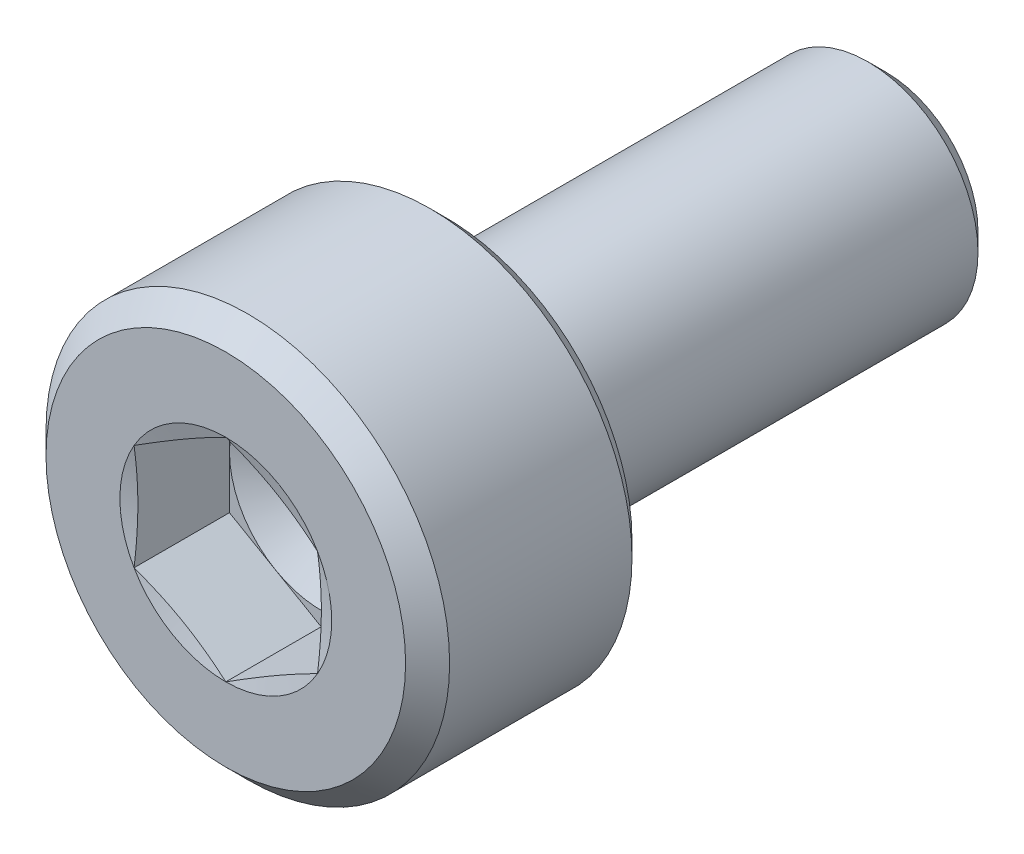
ISO-10303-21;
HEADER;
FILE_DESCRIPTION(('STEP AP214'),'2;1');
FILE_NAME('part.step','',(''),(''),'','','');
FILE_SCHEMA(('AUTOMOTIVE_DESIGN { 1 0 10303 214 1 1 1 1 }'));
ENDSEC;
DATA;
#1=APPLICATION_CONTEXT('core data for automotive mechanical design processes');
#2=APPLICATION_PROTOCOL_DEFINITION('international standard','automotive_design',2000,#1);
#3=PRODUCT_CONTEXT('',#1,'mechanical');
#4=PRODUCT('Part','Part','',(#3));
#5=PRODUCT_RELATED_PRODUCT_CATEGORY('part','',(#4));
#6=PRODUCT_DEFINITION_FORMATION('','',#4);
#7=PRODUCT_DEFINITION_CONTEXT('part definition',#1,'design');
#8=PRODUCT_DEFINITION('design','',#6,#7);
#9=PRODUCT_DEFINITION_SHAPE('','',#8);
#10=(LENGTH_UNIT() NAMED_UNIT(*) SI_UNIT(.MILLI.,.METRE.));
#11=(NAMED_UNIT(*) PLANE_ANGLE_UNIT() SI_UNIT($,.RADIAN.));
#12=(NAMED_UNIT(*) SI_UNIT($,.STERADIAN.) SOLID_ANGLE_UNIT());
#13=UNCERTAINTY_MEASURE_WITH_UNIT(LENGTH_MEASURE(1.E-05),#10,'distance_accuracy_value','');
#14=(GEOMETRIC_REPRESENTATION_CONTEXT(3) GLOBAL_UNCERTAINTY_ASSIGNED_CONTEXT((#13)) GLOBAL_UNIT_ASSIGNED_CONTEXT((#10,
#11,#12)) REPRESENTATION_CONTEXT('',''));
#15=CARTESIAN_POINT('',(0.,0.,0.));
#16=DIRECTION('',(0.,0.,1.));
#17=DIRECTION('',(1.,0.,0.));
#18=AXIS2_PLACEMENT_3D('',#15,#16,#17);
#19=CARTESIAN_POINT('',(1.25,0.721687836487033,-1.3));
#20=DIRECTION('',(0.5,0.866025403784439,0.));
#21=DIRECTION('',(0.,0.,-1.));
#22=AXIS2_PLACEMENT_3D('',#19,#20,#21);
#23=PLANE('',#22);
#24=CARTESIAN_POINT('',(0.,1.44337567297407,0.));
#25=CARTESIAN_POINT('',(0.0266010741574035,1.42801550344856,-0.00411563079121512));
#26=CARTESIAN_POINT('',(0.0532235716252887,1.41263958063488,-0.00803870308418439));
#27=CARTESIAN_POINT('',(0.105990950310015,1.38216656964672,-0.0153837682666469));
#28=CARTESIAN_POINT('',(0.132134938423043,1.36706993862756,-0.0188140917976724));
#29=CARTESIAN_POINT('',(0.184080896535333,1.33708618540438,-0.025174957981675));
#30=CARTESIAN_POINT('',(0.209882172940569,1.32219928511393,-0.0281121725270214));
#31=CARTESIAN_POINT('',(0.261290419336476,1.29254695927157,-0.0334872092687405));
#32=CARTESIAN_POINT('',(0.286897013202713,1.27778166527025,-0.0359293451582305));
#33=CARTESIAN_POINT('',(0.338814014231531,1.24779551622449,-0.0403875802559015));
#34=CARTESIAN_POINT('',(0.365124701320746,1.23257315304511,-0.0423903504078004));
#35=CARTESIAN_POINT('',(0.41739626342825,1.20233457949772,-0.0458161323987716));
#36=CARTESIAN_POINT('',(0.443356722749427,1.18731855544823,-0.0472470738867774));
#37=CARTESIAN_POINT('',(0.495189289691946,1.15738161600266,-0.0495320426407517));
#38=CARTESIAN_POINT('',(0.521061212339776,1.14246059341946,-0.0503888439825338));
#39=CARTESIAN_POINT('',(0.572960169546127,1.112545265764,-0.0515316995489692));
#40=CARTESIAN_POINT('',(0.598987292307348,1.09755099650677,-0.0518146703940937));
#41=CARTESIAN_POINT('',(0.651001958011103,1.06751871961563,-0.0518150403478976));
#42=CARTESIAN_POINT('',(0.676989512865152,1.0524807326171,-0.0515326731292534));
#43=CARTESIAN_POINT('',(0.728831950621195,1.02250093089559,-0.0503906133892446));
#44=CARTESIAN_POINT('',(0.754686839083206,1.00755901473306,-0.049533851076964));
#45=CARTESIAN_POINT('',(0.806530383134818,0.977641594560691,-0.0472488111413174));
#46=CARTESIAN_POINT('',(0.832519038985485,0.962666316501925,-0.0458176006639986));
#47=CARTESIAN_POINT('',(0.88485675257379,0.932508881624223,-0.0423912966395548));
#48=CARTESIAN_POINT('',(0.911205415535616,0.917326964095512,-0.0403881252485901));
#49=CARTESIAN_POINT('',(0.963136866609753,0.88735267068188,-0.035930182334875));
#50=CARTESIAN_POINT('',(0.988721142724691,0.872560833289737,-0.0334890493531678));
#51=CARTESIAN_POINT('',(1.04009703212967,0.842869124815658,-0.028115294806166));
#52=CARTESIAN_POINT('',(1.0658883492984,0.827969535565703,-0.0251782943883381));
#53=CARTESIAN_POINT('',(1.11782834522753,0.797976194945342,-0.0188173828427319));
#54=CARTESIAN_POINT('',(1.14397648287602,0.782882943312323,-0.0153867360503964));
#55=CARTESIAN_POINT('',(1.19675851906724,0.752418637222199,-0.0080404922123379));
#56=CARTESIAN_POINT('',(1.22339156591776,0.737048126643099,-0.00411650230644957));
#57=CARTESIAN_POINT('',(1.25,0.721687836487034,0.));
#58=B_SPLINE_CURVE_WITH_KNOTS('',3,(#24,#25,#26,#27,#28,#29,#30,#31,#32,#33,#34,#35,#36,#37,#38,
#39,#40,#41,#42,#43,#44,#45,#46,#47,#48,#49,#50,#51,#52,#53,#54,#55,#56,#57),.UNSPECIFIED.,.F.,
.F.,(4,2,2,2,2,2,2,2,2,2,2,2,2,2,2,2,4),(0.,0.0929756429984322,0.184124524266457,
0.273918330281164,0.362892504558264,0.454276274812247,0.544344744756976,0.633974830661911,
0.724085265734565,0.814158462912087,0.903775623702066,0.993856267691678,1.0852780295682,
1.17423384973417,1.26402077718908,1.35517544424662,1.44817056877235),.UNSPECIFIED.);
#59=CARTESIAN_POINT('',(0.,1.44337567297406,0.));
#60=VERTEX_POINT('',#59);
#61=CARTESIAN_POINT('',(1.25,0.721687836487034,0.));
#62=VERTEX_POINT('',#61);
#63=EDGE_CURVE('E249',#60,#62,#58,.T.);
#64=ORIENTED_EDGE('',*,*,#63,.F.);
#65=DIRECTION('',(0.,0.,1.));
#66=VECTOR('',#65,1.);
#67=CARTESIAN_POINT('',(0.,1.44337567297406,-1.3));
#68=LINE('',#67,#66);
#69=CARTESIAN_POINT('',(0.,1.44337567297406,-1.3));
#70=VERTEX_POINT('',#69);
#71=EDGE_CURVE('E361',#70,#60,#68,.T.);
#72=ORIENTED_EDGE('',*,*,#71,.F.);
#73=DIRECTION('',(-0.866025403784439,0.5,0.));
#74=VECTOR('',#73,1.);
#75=CARTESIAN_POINT('',(1.25,0.721687836487033,-1.3));
#76=LINE('',#75,#74);
#77=CARTESIAN_POINT('',(0.625,1.08253175473055,-1.3));
#78=VERTEX_POINT('',#77);
#79=EDGE_CURVE('E209',#78,#70,#76,.T.);
#80=ORIENTED_EDGE('',*,*,#79,.F.);
#81=DIRECTION('',(-0.866025403784439,0.5,0.));
#82=VECTOR('',#81,1.);
#83=CARTESIAN_POINT('',(1.25,0.721687836487033,-1.3));
#84=LINE('',#83,#82);
#85=CARTESIAN_POINT('',(1.25,0.721687836487033,-1.3));
#86=VERTEX_POINT('',#85);
#87=EDGE_CURVE('E224',#86,#78,#84,.T.);
#88=ORIENTED_EDGE('',*,*,#87,.F.);
#89=DIRECTION('',(0.,0.,1.));
#90=VECTOR('',#89,1.);
#91=CARTESIAN_POINT('',(1.25,0.721687836487033,-1.3));
#92=LINE('',#91,#90);
#93=EDGE_CURVE('E11',#86,#62,#92,.T.);
#94=ORIENTED_EDGE('',*,*,#93,.T.);
#95=EDGE_LOOP('',(#64,#72,#80,#88,#94));
#96=FACE_BOUND('',#95,.T.);
#97=ADVANCED_FACE('F17',(#96),#23,.F.);
#98=CARTESIAN_POINT('',(1.25,-0.721687836487033,-1.3));
#99=DIRECTION('',(1.,0.,0.));
#100=DIRECTION('',(0.,-1.,0.));
#101=AXIS2_PLACEMENT_3D('',#98,#99,#100);
#102=PLANE('',#101);
#103=CARTESIAN_POINT('',(1.25,0.721687836487034,0.));
#104=CARTESIAN_POINT('',(1.24999823698251,0.690999940764968,-0.0041116921545435));
#105=CARTESIAN_POINT('',(1.24999343638009,0.660285670486277,-0.0080312219209347));
#106=CARTESIAN_POINT('',(1.24998639785537,0.599409952891843,-0.0153701172192225));
#107=CARTESIAN_POINT('',(1.24998411141551,0.569249506080653,-0.0187977996777385));
#108=CARTESIAN_POINT('',(1.24998996305486,0.509329780508077,-0.0251543025812117));
#109=CARTESIAN_POINT('',(1.24999794646817,0.479571212976206,-0.0280897892747288));
#110=CARTESIAN_POINT('',(1.2500223367559,0.420283812845672,-0.0334622466755174));
#111=CARTESIAN_POINT('',(1.25003866580902,0.39075537251126,-0.0359035370987912));
#112=CARTESIAN_POINT('',(1.25002873622066,0.330797047066719,-0.0403659968356117));
#113=CARTESIAN_POINT('',(1.25000121650915,0.300366084889518,-0.0423727707061422));
#114=CARTESIAN_POINT('',(1.2499487716613,0.239913774778711,-0.0458055537624093));
#115=CARTESIAN_POINT('',(1.24992381469335,0.209892884574225,-0.0472395610352221));
#116=CARTESIAN_POINT('',(1.24991464001477,0.149977872401545,-0.0495283234961986));
#117=CARTESIAN_POINT('',(1.24993022107687,0.120083859273445,-0.0503859133498061));
#118=CARTESIAN_POINT('',(1.24996835071472,0.0601265989330451,-0.0515327901252948));
#119=CARTESIAN_POINT('',(1.24999093574578,0.030063293747345,-0.0518190439098863));
#120=CARTESIAN_POINT('',(1.25,0.,-0.0518148554092244));
#121=B_SPLINE_CURVE_WITH_KNOTS('',3,(#103,#104,#105,#106,#107,#108,#109,#110,#111,#112,#113,
#114,#115,#116,#117,#118,#119,#120),.UNSPECIFIED.,.F.,.F.,(4,2,2,2,2,2,2,2,4),(0.,
0.0928866686125054,0.18394754574854,0.273652950549812,0.362536731833363,0.454023240761691,
0.544183383798673,0.633896834523419,0.72408530693755),.UNSPECIFIED.);
#122=CARTESIAN_POINT('',(1.25,0.,-0.0518148554092244));
#123=VERTEX_POINT('',#122);
#124=EDGE_CURVE('E255',#62,#123,#121,.T.);
#125=ORIENTED_EDGE('',*,*,#124,.F.);
#126=ORIENTED_EDGE('',*,*,#93,.F.);
#127=DIRECTION('',(0.,1.,0.));
#128=VECTOR('',#127,1.);
#129=CARTESIAN_POINT('',(1.25,-0.721687836487033,-1.3));
#130=LINE('',#129,#128);
#131=CARTESIAN_POINT('',(1.25,0.,-1.3));
#132=VERTEX_POINT('',#131);
#133=EDGE_CURVE('E228',#132,#86,#130,.T.);
#134=ORIENTED_EDGE('',*,*,#133,.F.);
#135=DIRECTION('',(0.,1.,0.));
#136=VECTOR('',#135,1.);
#137=CARTESIAN_POINT('',(1.25,-0.721687836487033,-1.3));
#138=LINE('',#137,#136);
#139=CARTESIAN_POINT('',(1.25,-0.721687836487033,-1.3));
#140=VERTEX_POINT('',#139);
#141=EDGE_CURVE('E201',#140,#132,#138,.T.);
#142=ORIENTED_EDGE('',*,*,#141,.F.);
#143=DIRECTION('',(0.,0.,1.));
#144=VECTOR('',#143,1.);
#145=CARTESIAN_POINT('',(1.25,-0.721687836487033,-1.3));
#146=LINE('',#145,#144);
#147=CARTESIAN_POINT('',(1.25,-0.721687836487031,0.));
#148=VERTEX_POINT('',#147);
#149=EDGE_CURVE('E31',#140,#148,#146,.T.);
#150=ORIENTED_EDGE('',*,*,#149,.T.);
#151=CARTESIAN_POINT('',(1.25,0.,-0.0518148554092244));
#152=CARTESIAN_POINT('',(1.24999097697891,-0.0300388242332713,-0.0518190278008075));
#153=CARTESIAN_POINT('',(1.24996934760271,-0.0600776555269679,-0.0515329955368294));
#154=CARTESIAN_POINT('',(1.24993379974361,-0.119991561939784,-0.05038720494537));
#155=CARTESIAN_POINT('',(1.24991984260544,-0.149866692950213,-0.0495303717689572));
#156=CARTESIAN_POINT('',(1.24993183671915,-0.209749120653996,-0.0472437357421163));
#157=CARTESIAN_POINT('',(1.24995799405163,-0.239756304838218,-0.0458110022567921));
#158=CARTESIAN_POINT('',(1.25001075989497,-0.300186021092445,-0.0423815066628743));
#159=CARTESIAN_POINT('',(1.25003736932907,-0.330608091422305,-0.040376671117203));
#160=CARTESIAN_POINT('',(1.2500446486428,-0.39057222202749,-0.0359167393057105));
#161=CARTESIAN_POINT('',(1.25002656990743,-0.420115329127233,-0.0334756444191961));
#162=CARTESIAN_POINT('',(1.24999981108288,-0.479432961970562,-0.0281026849191924));
#163=CARTESIAN_POINT('',(1.24999121968782,-0.509207093749055,-0.0251664799491732));
#164=CARTESIAN_POINT('',(1.24998452367544,-0.569159340782016,-0.0188078031597437));
#165=CARTESIAN_POINT('',(1.24998657991599,-0.599336742030467,-0.0153786379059865));
#166=CARTESIAN_POINT('',(1.24999338873797,-0.660248180215888,-0.00803601627135115));
#167=CARTESIAN_POINT('',(1.24999819468793,-0.690981212849153,-0.0041142106816611));
#168=CARTESIAN_POINT('',(1.25,-0.72168783648703,0.));
#169=B_SPLINE_CURVE_WITH_KNOTS('',3,(#151,#152,#153,#154,#155,#156,#157,#158,#159,#160,#161,
#162,#163,#164,#165,#166,#167,#168),.UNSPECIFIED.,.F.,.F.,(4,2,2,2,2,2,2,2,4),(0.,
0.0901150585143207,0.179771826003305,0.26989073371865,0.361350251095626,0.450277827988882,
0.540029901554553,0.631141813166489,0.72408517261877),.UNSPECIFIED.);
#170=EDGE_CURVE('E481',#123,#148,#169,.T.);
#171=ORIENTED_EDGE('',*,*,#170,.F.);
#172=EDGE_LOOP('',(#125,#126,#134,#142,#150,#171));
#173=FACE_BOUND('',#172,.T.);
#174=ADVANCED_FACE('F439',(#173),#102,.F.);
#175=CARTESIAN_POINT('',(0.,-1.44337567297406,-1.3));
#176=DIRECTION('',(0.5,-0.866025403784439,0.));
#177=DIRECTION('',(0.,0.,-1.));
#178=AXIS2_PLACEMENT_3D('',#175,#176,#177);
#179=PLANE('',#178);
#180=CARTESIAN_POINT('',(1.25,-0.72168783648703,0.));
#181=CARTESIAN_POINT('',(1.2233971659058,-0.737044957712528,-0.00411563079121149));
#182=CARTESIAN_POINT('',(1.19676997740861,-0.752412755425053,-0.00803870308417673));
#183=CARTESIAN_POINT('',(1.14399588642073,-0.782874140363045,-0.0153837682666341));
#184=CARTESIAN_POINT('',(1.11784982639007,-0.797967182715585,-0.018814091797658));
#185=CARTESIAN_POINT('',(1.06591015534185,-0.827961825453168,-0.0251749579816608));
#186=CARTESIAN_POINT('',(1.04011708330409,-0.842862936124947,-0.0281121725270084));
#187=CARTESIAN_POINT('',(0.988733292645323,-0.872557620546649,-0.0334872092687323));
#188=CARTESIAN_POINT('',(0.963142876012687,-0.88735093433855,-0.0359293451582256));
#189=CARTESIAN_POINT('',(0.91121560866282,-0.917319301594997,-0.0403875802559157));
#190=CARTESIAN_POINT('',(0.884877311899103,-0.932493843415649,-0.0423903504078287));
#191=CARTESIAN_POINT('',(0.832554157978914,-0.962643057322603,-0.0458161323988174));
#192=CARTESIAN_POINT('',(0.806569670027579,-0.977617462563912,-0.0472470738868286));
#193=CARTESIAN_POINT('',(0.754727236484892,-1.00753731255668,-0.0495320426408034));
#194=CARTESIAN_POINT('',(0.728869290553528,-1.02248254352281,-0.0503888439825823));
#195=CARTESIAN_POINT('',(0.677012378238376,-1.05247069506564,-0.0515316995489991));
#196=CARTESIAN_POINT('',(0.651013398769965,-1.06751370993562,-0.0518146703941098));
#197=CARTESIAN_POINT('',(0.598997351197246,-1.09754359335878,-0.051815040347882));
#198=CARTESIAN_POINT('',(0.57298029500795,-1.11253048254531,-0.0515326731292214));
#199=CARTESIAN_POINT('',(0.521095806239011,-1.14243744977536,-0.0503906133891943));
#200=CARTESIAN_POINT('',(0.495228283030122,-1.15735748191422,-0.0495338510769088));
#201=CARTESIAN_POINT('',(0.443397265119366,-1.18729659799899,-0.0472488111412611));
#202=CARTESIAN_POINT('',(0.417433965966339,-1.20231579514653,-0.0458176006639436));
#203=CARTESIAN_POINT('',(0.365148004454804,-1.2325628672512,-0.0423912966395229));
#204=CARTESIAN_POINT('',(0.338825746715614,-1.24779051996754,-0.0403881252485777));
#205=CARTESIAN_POINT('',(0.28690152162188,-1.27777732914604,-0.0359301823349323));
#206=CARTESIAN_POINT('',(0.261299276614448,-1.29253804350266,-0.0334890493532856));
#207=CARTESIAN_POINT('',(0.209897558092061,-1.32218501463202,-0.0281152948063626));
#208=CARTESIAN_POINT('',(0.184098476711416,-1.33707115587218,-0.025178294388549));
#209=CARTESIAN_POINT('',(0.13215348382532,-1.36705584150914,-0.0188173828429405));
#210=CARTESIAN_POINT('',(0.106008275661093,-1.38215416715798,-0.0153867360505843));
#211=CARTESIAN_POINT('',(0.0532343945823571,-1.41263259831833,-0.00804049221245096));
#212=CARTESIAN_POINT('',(0.0266066185261265,-1.42801223818175,-0.00411650230650442));
#213=CARTESIAN_POINT('',(0.,-1.44337567297406,0.));
#214=B_SPLINE_CURVE_WITH_KNOTS('',3,(#180,#181,#182,#183,#184,#185,#186,#187,#188,#189,#190,
#191,#192,#193,#194,#195,#196,#197,#198,#199,#200,#201,#202,#203,#204,#205,#206,#207,#208,#209,
#210,#211,#212,#213),.UNSPECIFIED.,.F.,.F.,(4,2,2,2,2,2,2,2,2,2,2,2,2,2,2,2,4),(0.,
0.0929756429983488,0.18412452426635,0.273918330281088,0.362892504558272,0.454276274812701,
0.544344744757564,0.633974830662343,0.72408526573457,0.814158462911407,0.903775623701171,
0.993856267691015,1.0852780295682,1.17423384973301,1.26402077718748,1.3551754442454,
1.44817056877235),.UNSPECIFIED.);
#215=CARTESIAN_POINT('',(0.,-1.44337567297406,0.));
#216=VERTEX_POINT('',#215);
#217=EDGE_CURVE('E423',#148,#216,#214,.T.);
#218=ORIENTED_EDGE('',*,*,#217,.F.);
#219=ORIENTED_EDGE('',*,*,#149,.F.);
#220=DIRECTION('',(0.866025403784439,0.5,0.));
#221=VECTOR('',#220,1.);
#222=CARTESIAN_POINT('',(0.,-1.44337567297406,-1.3));
#223=LINE('',#222,#221);
#224=CARTESIAN_POINT('',(0.625,-1.08253175473055,-1.3));
#225=VERTEX_POINT('',#224);
#226=EDGE_CURVE('E204',#225,#140,#223,.T.);
#227=ORIENTED_EDGE('',*,*,#226,.F.);
#228=DIRECTION('',(0.866025403784439,0.5,0.));
#229=VECTOR('',#228,1.);
#230=CARTESIAN_POINT('',(0.,-1.44337567297406,-1.3));
#231=LINE('',#230,#229);
#232=CARTESIAN_POINT('',(0.,-1.44337567297406,-1.3));
#233=VERTEX_POINT('',#232);
#234=EDGE_CURVE('E192',#233,#225,#231,.T.);
#235=ORIENTED_EDGE('',*,*,#234,.F.);
#236=DIRECTION('',(0.,0.,1.));
#237=VECTOR('',#236,1.);
#238=CARTESIAN_POINT('',(0.,-1.44337567297406,-1.3));
#239=LINE('',#238,#237);
#240=EDGE_CURVE('E360',#233,#216,#239,.T.);
#241=ORIENTED_EDGE('',*,*,#240,.T.);
#242=EDGE_LOOP('',(#218,#219,#227,#235,#241));
#243=FACE_BOUND('',#242,.T.);
#244=ADVANCED_FACE('F430',(#243),#179,.F.);
#245=CARTESIAN_POINT('',(-1.25,-0.721687836487032,-1.3));
#246=DIRECTION('',(-0.5,-0.866025403784439,0.));
#247=DIRECTION('',(-0.866025403784439,0.5,0.));
#248=AXIS2_PLACEMENT_3D('',#245,#246,#247);
#249=PLANE('',#248);
#250=CARTESIAN_POINT('',(0.,-1.44337567297406,0.));
#251=CARTESIAN_POINT('',(-0.0266010741573072,-1.42801550344862,-0.00411563079120053));
#252=CARTESIAN_POINT('',(-0.0532235716251028,-1.412639580635,-0.00803870308415418));
#253=CARTESIAN_POINT('',(-0.105990950309719,-1.38216656964693,-0.0153837682665966));
#254=CARTESIAN_POINT('',(-0.132134938422726,-1.3670699386278,-0.0188140917976166));
#255=CARTESIAN_POINT('',(-0.184080896535033,-1.33708618540464,-0.0251749579816186));
#256=CARTESIAN_POINT('',(-0.209882172940307,-1.32219928511417,-0.0281121725269688));
#257=CARTESIAN_POINT('',(-0.261290419336326,-1.29254695927172,-0.0334872092687093));
#258=CARTESIAN_POINT('',(-0.286897013202638,-1.27778166527032,-0.0359293451582158));
#259=CARTESIAN_POINT('',(-0.338814014231424,-1.24779551622451,-0.0403875802559013));
#260=CARTESIAN_POINT('',(-0.365124701320532,-1.23257315304517,-0.0423903504078018));
#261=CARTESIAN_POINT('',(-0.417396263427902,-1.20233457949783,-0.0458161323987747));
#262=CARTESIAN_POINT('',(-0.443356722749052,-1.18731855544836,-0.0472470738867794));
#263=CARTESIAN_POINT('',(-0.495189289691583,-1.15738161600281,-0.0495320426407528));
#264=CARTESIAN_POINT('',(-0.521061212339452,-1.14246059341961,-0.0503888439825337));
#265=CARTESIAN_POINT('',(-0.572960169545936,-1.11254526576409,-0.0515316995489712));
#266=CARTESIAN_POINT('',(-0.59898729230725,-1.09755099650681,-0.0518146703940977));
#267=CARTESIAN_POINT('',(-0.651001958010772,-1.06751871961583,-0.0518150403478942));
#268=CARTESIAN_POINT('',(-0.676989512864494,-1.05248073261752,-0.0515326731292499));
#269=CARTESIAN_POINT('',(-0.728831950620127,-1.02250093089636,-0.0503906133892435));
#270=CARTESIAN_POINT('',(-0.754686839082053,-1.00755901473394,-0.0495338510769603));
#271=CARTESIAN_POINT('',(-0.806530383133706,-0.97764159456164,-0.0472488111413116));
#272=CARTESIAN_POINT('',(-0.832519038984498,-0.962666316502832,-0.0458176006639886));
#273=CARTESIAN_POINT('',(-0.884856752573216,-0.932508881624801,-0.0423912966395508));
#274=CARTESIAN_POINT('',(-0.911205415535328,-0.917326964095802,-0.0403881252485919));
#275=CARTESIAN_POINT('',(-0.963136866609371,-0.887352670681979,-0.0359301823349303));
#276=CARTESIAN_POINT('',(-0.98872114272393,-0.872560833289935,-0.0334890493532837));
#277=CARTESIAN_POINT('',(-1.04009703212842,-0.842869124816045,-0.0281152948063605));
#278=CARTESIAN_POINT('',(-1.06588834929704,-0.827969535566183,-0.0251782943885465));
#279=CARTESIAN_POINT('',(-1.11782834522619,-0.797976194945903,-0.0188173828429378));
#280=CARTESIAN_POINT('',(-1.1439764828748,-0.782882943312871,-0.0153867360505819));
#281=CARTESIAN_POINT('',(-1.19675851906652,-0.752418637222568,-0.00804049221244955));
#282=CARTESIAN_POINT('',(-1.22339156591741,-0.7370481266433,-0.00411650230650377));
#283=CARTESIAN_POINT('',(-1.25,-0.721687836487036,0.));
#284=B_SPLINE_CURVE_WITH_KNOTS('',3,(#250,#251,#252,#253,#254,#255,#256,#257,#258,#259,#260,
#261,#262,#263,#264,#265,#266,#267,#268,#269,#270,#271,#272,#273,#274,#275,#276,#277,#278,#279,
#280,#281,#282,#283),.UNSPECIFIED.,.F.,.F.,(4,2,2,2,2,2,2,2,2,2,2,2,2,2,2,2,4),(0.,
0.0929756429981014,0.184124524266029,0.273918330280853,0.362892504558266,0.454276274811929,
0.544344744756552,0.633974830661595,0.724085265734569,0.814158462910913,0.9037756237005,
0.993856267690502,1.0852780295682,1.17423384973303,1.2640207771875,1.35517544424541,
1.44817056877234),.UNSPECIFIED.);
#285=CARTESIAN_POINT('',(-1.25,-0.721687836487033,0.));
#286=VERTEX_POINT('',#285);
#287=EDGE_CURVE('E347',#216,#286,#284,.T.);
#288=ORIENTED_EDGE('',*,*,#287,.F.);
#289=ORIENTED_EDGE('',*,*,#240,.F.);
#290=DIRECTION('',(0.866025403784439,-0.5,0.));
#291=VECTOR('',#290,1.);
#292=CARTESIAN_POINT('',(-1.25,-0.721687836487032,-1.3));
#293=LINE('',#292,#291);
#294=CARTESIAN_POINT('',(-0.625,-1.08253175473055,-1.3));
#295=VERTEX_POINT('',#294);
#296=EDGE_CURVE('E172',#295,#233,#293,.T.);
#297=ORIENTED_EDGE('',*,*,#296,.F.);
#298=DIRECTION('',(0.866025403784439,-0.5,0.));
#299=VECTOR('',#298,1.);
#300=CARTESIAN_POINT('',(-1.25,-0.721687836487032,-1.3));
#301=LINE('',#300,#299);
#302=CARTESIAN_POINT('',(-1.25,-0.721687836487032,-1.3));
#303=VERTEX_POINT('',#302);
#304=EDGE_CURVE('E191',#303,#295,#301,.T.);
#305=ORIENTED_EDGE('',*,*,#304,.F.);
#306=DIRECTION('',(0.,0.,1.));
#307=VECTOR('',#306,1.);
#308=CARTESIAN_POINT('',(-1.25,-0.721687836487032,-1.3));
#309=LINE('',#308,#307);
#310=EDGE_CURVE('E352',#303,#286,#309,.T.);
#311=ORIENTED_EDGE('',*,*,#310,.T.);
#312=EDGE_LOOP('',(#288,#289,#297,#305,#311));
#313=FACE_BOUND('',#312,.T.);
#314=ADVANCED_FACE('F329',(#313),#249,.F.);
#315=CARTESIAN_POINT('',(-1.25,0.721687836487033,-1.3));
#316=DIRECTION('',(-1.,0.,0.));
#317=DIRECTION('',(0.,0.,1.));
#318=AXIS2_PLACEMENT_3D('',#315,#316,#317);
#319=PLANE('',#318);
#320=CARTESIAN_POINT('',(-1.25,-0.721687836487036,0.));
#321=CARTESIAN_POINT('',(-1.24999821886412,-0.690932210000902,-0.00412077366792503));
#322=CARTESIAN_POINT('',(-1.24999387857277,-0.660150074866336,-0.00804841753616333));
#323=CARTESIAN_POINT('',(-1.24998827175687,-0.599138517352571,-0.0154014380852009));
#324=CARTESIAN_POINT('',(-1.24998694660483,-0.568910098118886,-0.0188351562390941));
#325=CARTESIAN_POINT('',(-1.24999480562822,-0.508853302588297,-0.0252016317976271));
#326=CARTESIAN_POINT('',(-1.25000383433192,-0.479025637483938,-0.0281410598390331));
#327=CARTESIAN_POINT('',(-1.25002969465079,-0.419597741693308,-0.0335193354014606));
#328=CARTESIAN_POINT('',(-1.25004645478338,-0.389997900664602,-0.0359624795469015));
#329=CARTESIAN_POINT('',(-1.25003624698015,-0.329932451723906,-0.0404235084844104));
#330=CARTESIAN_POINT('',(-1.25000804135667,-0.299465811483142,-0.0424275685535516));
#331=CARTESIAN_POINT('',(-1.24995480282112,-0.238942721030509,-0.0458531334643784));
#332=CARTESIAN_POINT('',(-1.24992972983623,-0.208886728419523,-0.0472826637209089));
#333=CARTESIAN_POINT('',(-1.24991813207592,-0.148900847883205,-0.0495620346762597));
#334=CARTESIAN_POINT('',(-1.24993141807717,-0.11897106783738,-0.0504146953997261));
#335=CARTESIAN_POINT('',(-1.24997269319909,-0.0589403752630816,-0.0515465360951228));
#336=CARTESIAN_POINT('',(-1.25000076068601,-0.0288394047107543,-0.0518226201453485));
#337=CARTESIAN_POINT('',(-1.24999924183589,0.0312625879908033,-0.051806775859687));
#338=CARTESIAN_POINT('',(-1.24996984632998,0.0612636106529509,-0.051516727619696));
#339=CARTESIAN_POINT('',(-1.24992780073287,0.121103798973637,-0.0503604178239));
#340=CARTESIAN_POINT('',(-1.24991506723406,0.150943020383787,-0.049497059210113));
#341=CARTESIAN_POINT('',(-1.24992723273208,0.21075428356878,-0.0471998946158216));
#342=CARTESIAN_POINT('',(-1.2499523271874,0.240726211851809,-0.0457631542002465));
#343=CARTESIAN_POINT('',(-1.25000360417568,0.301084835090529,-0.0423268298904389));
#344=CARTESIAN_POINT('',(-1.25002979734107,0.331471068197909,-0.0403191918787037));
#345=CARTESIAN_POINT('',(-1.25003699758531,0.391328089389752,-0.0358577918245045));
#346=CARTESIAN_POINT('',(-1.25001928795661,0.42079996858613,-0.0334185904444356));
#347=CARTESIAN_POINT('',(-1.24999394681244,0.479977430952503,-0.0280514827152005));
#348=CARTESIAN_POINT('',(-1.24998641124457,0.509682617587425,-0.0251192130216116));
#349=CARTESIAN_POINT('',(-1.24998172156504,0.569498085241384,-0.0187704983671833));
#350=CARTESIAN_POINT('',(-1.24998472717054,0.599607652246593,-0.0153473647873735));
#351=CARTESIAN_POINT('',(-1.2499929474011,0.660383517909659,-0.00801885284655767));
#352=CARTESIAN_POINT('',(-1.24999820530047,0.691048814920108,-0.00410514993995136));
#353=CARTESIAN_POINT('',(-1.25,0.721687836487032,0.));
#354=B_SPLINE_CURVE_WITH_KNOTS('',3,(#320,#321,#322,#323,#324,#325,#326,#327,#328,#329,#330,
#331,#332,#333,#334,#335,#336,#337,#338,#339,#340,#341,#342,#343,#344,#345,#346,#347,#348,#349,
#350,#351,#352,#353),.UNSPECIFIED.,.F.,.F.,(4,2,2,2,2,2,2,2,2,2,2,2,2,2,2,2,4),(0.,
0.0930916808948182,0.184357193016995,0.274270023536689,0.363367712388216,0.454960459263653,
0.545225160616974,0.635045351768193,0.725346604253175,0.815348481166214,0.904898075925872,
0.994911965590393,1.0862647637543,1.17497894838529,1.26452405113569,1.35543174170835,
1.44817047837161),.UNSPECIFIED.);
#355=CARTESIAN_POINT('',(-1.25,0.721687836487033,0.));
#356=VERTEX_POINT('',#355);
#357=EDGE_CURVE('E375',#286,#356,#354,.T.);
#358=ORIENTED_EDGE('',*,*,#357,.F.);
#359=ORIENTED_EDGE('',*,*,#310,.F.);
#360=DIRECTION('',(0.,-1.,0.));
#361=VECTOR('',#360,1.);
#362=CARTESIAN_POINT('',(-1.25,0.721687836487033,-1.3));
#363=LINE('',#362,#361);
#364=CARTESIAN_POINT('',(-1.25,0.,-1.3));
#365=VERTEX_POINT('',#364);
#366=EDGE_CURVE('E187',#365,#303,#363,.T.);
#367=ORIENTED_EDGE('',*,*,#366,.F.);
#368=DIRECTION('',(0.,-1.,0.));
#369=VECTOR('',#368,1.);
#370=CARTESIAN_POINT('',(-1.25,0.721687836487033,-1.3));
#371=LINE('',#370,#369);
#372=CARTESIAN_POINT('',(-1.25,0.721687836487033,-1.3));
#373=VERTEX_POINT('',#372);
#374=EDGE_CURVE('E183',#373,#365,#371,.T.);
#375=ORIENTED_EDGE('',*,*,#374,.F.);
#376=DIRECTION('',(0.,0.,1.));
#377=VECTOR('',#376,1.);
#378=CARTESIAN_POINT('',(-1.25,0.721687836487033,-1.3));
#379=LINE('',#378,#377);
#380=EDGE_CURVE('E46',#373,#356,#379,.T.);
#381=ORIENTED_EDGE('',*,*,#380,.T.);
#382=EDGE_LOOP('',(#358,#359,#367,#375,#381));
#383=FACE_BOUND('',#382,.T.);
#384=ADVANCED_FACE('F391',(#383),#319,.F.);
#385=CARTESIAN_POINT('',(0.,1.44337567297406,-1.3));
#386=DIRECTION('',(-0.5,0.866025403784439,0.));
#387=DIRECTION('',(0.,0.,1.));
#388=AXIS2_PLACEMENT_3D('',#385,#386,#387);
#389=PLANE('',#388);
#390=CARTESIAN_POINT('',(-1.25,0.721687836487032,0.));
#391=CARTESIAN_POINT('',(-1.22339716590584,0.737044957712511,-0.00411563079120637));
#392=CARTESIAN_POINT('',(-1.19676997740868,0.752412755425021,-0.00803870308416613));
#393=CARTESIAN_POINT('',(-1.14399588642084,0.782874140362995,-0.0153837682666164));
#394=CARTESIAN_POINT('',(-1.1178498263902,0.797967182715534,-0.0188140917976384));
#395=CARTESIAN_POINT('',(-1.06591015534198,0.827961825453124,-0.0251749579816409));
#396=CARTESIAN_POINT('',(-1.04011708330421,0.842862936124911,-0.0281121725269898));
#397=CARTESIAN_POINT('',(-0.988733292645396,0.87255762054663,-0.0334872092687212));
#398=CARTESIAN_POINT('',(-0.963142876012725,0.887350934338539,-0.0359293451582203));
#399=CARTESIAN_POINT('',(-0.911215608662851,0.917319301594967,-0.0403875802559155));
#400=CARTESIAN_POINT('',(-0.884877311899161,0.932493843415591,-0.042390350407829));
#401=CARTESIAN_POINT('',(-0.832554157979012,0.962643057322515,-0.0458161323988182));
#402=CARTESIAN_POINT('',(-0.806569670027688,0.97761746256382,-0.0472470738868289));
#403=CARTESIAN_POINT('',(-0.754727236485004,1.00753731255659,-0.0495320426408036));
#404=CARTESIAN_POINT('',(-0.728869290553631,1.02248254352274,-0.0503888439825824));
#405=CARTESIAN_POINT('',(-0.677012378238439,1.0524706950656,-0.0515316995489988));
#406=CARTESIAN_POINT('',(-0.651013398769998,1.06751370993561,-0.0518146703941088));
#407=CARTESIAN_POINT('',(-0.598997351197131,1.09754359335884,-0.0518150403478823));
#408=CARTESIAN_POINT('',(-0.572980295007719,1.11253048254543,-0.0515326731292221));
#409=CARTESIAN_POINT('',(-0.521095806238615,1.14243744977554,-0.0503906133891946));
#410=CARTESIAN_POINT('',(-0.49522828302968,1.1573574819144,-0.0495338510769098));
#411=CARTESIAN_POINT('',(-0.443397265118909,1.18729659799915,-0.0472488111412628));
#412=CARTESIAN_POINT('',(-0.417433965965914,1.20231579514667,-0.0458176006639467));
#413=CARTESIAN_POINT('',(-0.365148004454539,1.23256286725127,-0.042391296639524));
#414=CARTESIAN_POINT('',(-0.338825746715477,1.24779051996758,-0.0403881252485769));
#415=CARTESIAN_POINT('',(-0.286901521621781,1.27777732914614,-0.0359301823349139));
#416=CARTESIAN_POINT('',(-0.261299276614258,1.29253804350285,-0.0334890493532472));
#417=CARTESIAN_POINT('',(-0.209897558091737,1.32218501463232,-0.0281152948062984));
#418=CARTESIAN_POINT('',(-0.184098476711047,1.33707115587249,-0.0251782943884803));
#419=CARTESIAN_POINT('',(-0.132153483824933,1.36705584150943,-0.0188173828428726));
#420=CARTESIAN_POINT('',(-0.106008275660732,1.38215416715824,-0.0153867360505231));
#421=CARTESIAN_POINT('',(-0.0532343945821315,1.41263259831848,-0.00804049221241403));
#422=CARTESIAN_POINT('',(-0.0266066185260098,1.42801223818181,-0.00411650230648636));
#423=CARTESIAN_POINT('',(0.,1.44337567297407,0.));
#424=B_SPLINE_CURVE_WITH_KNOTS('',3,(#390,#391,#392,#393,#394,#395,#396,#397,#398,#399,#400,
#401,#402,#403,#404,#405,#406,#407,#408,#409,#410,#411,#412,#413,#414,#415,#416,#417,#418,#419,
#420,#421,#422,#423),.UNSPECIFIED.,.F.,.F.,(4,2,2,2,2,2,2,2,2,2,2,2,2,2,2,2,4),(0.,
0.0929756429982334,0.1841245242662,0.273918330280977,0.362892504558266,0.454276274812582,
0.54434474475741,0.633974830662229,0.72408526573457,0.814158462911794,0.903775623701688,
0.993856267691406,1.08527802956821,1.17423384973339,1.264020777188,1.3551754442458,
1.44817056877235),.UNSPECIFIED.);
#425=EDGE_CURVE('E466',#356,#60,#424,.T.);
#426=ORIENTED_EDGE('',*,*,#425,.F.);
#427=ORIENTED_EDGE('',*,*,#380,.F.);
#428=DIRECTION('',(-0.866025403784439,-0.5,0.));
#429=VECTOR('',#428,1.);
#430=CARTESIAN_POINT('',(0.,1.44337567297406,-1.3));
#431=LINE('',#430,#429);
#432=CARTESIAN_POINT('',(-0.625,1.08253175473055,-1.3));
#433=VERTEX_POINT('',#432);
#434=EDGE_CURVE('E186',#433,#373,#431,.T.);
#435=ORIENTED_EDGE('',*,*,#434,.F.);
#436=DIRECTION('',(-0.866025403784439,-0.5,0.));
#437=VECTOR('',#436,1.);
#438=CARTESIAN_POINT('',(0.,1.44337567297406,-1.3));
#439=LINE('',#438,#437);
#440=EDGE_CURVE('E205',#70,#433,#439,.T.);
#441=ORIENTED_EDGE('',*,*,#440,.F.);
#442=ORIENTED_EDGE('',*,*,#71,.T.);
#443=EDGE_LOOP('',(#426,#427,#435,#441,#442));
#444=FACE_BOUND('',#443,.T.);
#445=ADVANCED_FACE('F308',(#444),#389,.F.);
#446=CARTESIAN_POINT('',(0.,0.,-1.3));
#447=DIRECTION('',(0.,0.,1.));
#448=DIRECTION('',(1.,0.,0.));
#449=AXIS2_PLACEMENT_3D('',#446,#447,#448);
#450=PLANE('',#449);
#451=CARTESIAN_POINT('',(0.,0.,-1.3));
#452=DIRECTION('',(0.,0.,1.));
#453=DIRECTION('',(1.,0.,0.));
#454=AXIS2_PLACEMENT_3D('',#451,#452,#453);
#455=CIRCLE('',#454,1.25);
#456=EDGE_CURVE('E220',#433,#365,#455,.T.);
#457=ORIENTED_EDGE('',*,*,#456,.F.);
#458=ORIENTED_EDGE('',*,*,#434,.T.);
#459=ORIENTED_EDGE('',*,*,#374,.T.);
#460=EDGE_LOOP('',(#457,#458,#459));
#461=FACE_BOUND('',#460,.T.);
#462=ADVANCED_FACE('F304',(#461),#450,.T.);
#463=CARTESIAN_POINT('',(0.,0.,-1.3));
#464=DIRECTION('',(0.,0.,1.));
#465=DIRECTION('',(1.,0.,0.));
#466=AXIS2_PLACEMENT_3D('',#463,#464,#465);
#467=PLANE('',#466);
#468=CARTESIAN_POINT('',(0.,0.,-1.3));
#469=DIRECTION('',(0.,0.,1.));
#470=DIRECTION('',(1.,0.,0.));
#471=AXIS2_PLACEMENT_3D('',#468,#469,#470);
#472=CIRCLE('',#471,1.25);
#473=EDGE_CURVE('E197',#78,#433,#472,.T.);
#474=ORIENTED_EDGE('',*,*,#473,.F.);
#475=ORIENTED_EDGE('',*,*,#79,.T.);
#476=ORIENTED_EDGE('',*,*,#440,.T.);
#477=EDGE_LOOP('',(#474,#475,#476));
#478=FACE_BOUND('',#477,.T.);
#479=ADVANCED_FACE('F300',(#478),#467,.T.);
#480=CARTESIAN_POINT('',(0.,0.,-1.3));
#481=DIRECTION('',(0.,0.,1.));
#482=DIRECTION('',(1.,0.,0.));
#483=AXIS2_PLACEMENT_3D('',#480,#481,#482);
#484=PLANE('',#483);
#485=CARTESIAN_POINT('',(0.,0.,-1.3));
#486=DIRECTION('',(0.,0.,1.));
#487=DIRECTION('',(1.,0.,0.));
#488=AXIS2_PLACEMENT_3D('',#485,#486,#487);
#489=CIRCLE('',#488,1.25);
#490=EDGE_CURVE('E214',#365,#295,#489,.T.);
#491=ORIENTED_EDGE('',*,*,#490,.F.);
#492=ORIENTED_EDGE('',*,*,#366,.T.);
#493=ORIENTED_EDGE('',*,*,#304,.T.);
#494=EDGE_LOOP('',(#491,#492,#493));
#495=FACE_BOUND('',#494,.T.);
#496=ADVANCED_FACE('F303',(#495),#484,.T.);
#497=CARTESIAN_POINT('',(0.,0.,-1.3));
#498=DIRECTION('',(0.,0.,1.));
#499=DIRECTION('',(1.,0.,0.));
#500=AXIS2_PLACEMENT_3D('',#497,#498,#499);
#501=PLANE('',#500);
#502=CARTESIAN_POINT('',(0.,0.,-1.3));
#503=DIRECTION('',(0.,0.,1.));
#504=DIRECTION('',(1.,0.,0.));
#505=AXIS2_PLACEMENT_3D('',#502,#503,#504);
#506=CIRCLE('',#505,1.25);
#507=EDGE_CURVE('E210',#295,#225,#506,.T.);
#508=ORIENTED_EDGE('',*,*,#507,.F.);
#509=ORIENTED_EDGE('',*,*,#296,.T.);
#510=ORIENTED_EDGE('',*,*,#234,.T.);
#511=EDGE_LOOP('',(#508,#509,#510));
#512=FACE_BOUND('',#511,.T.);
#513=ADVANCED_FACE('F319',(#512),#501,.T.);
#514=CARTESIAN_POINT('',(0.,0.,-1.3));
#515=DIRECTION('',(0.,0.,1.));
#516=DIRECTION('',(1.,0.,0.));
#517=AXIS2_PLACEMENT_3D('',#514,#515,#516);
#518=PLANE('',#517);
#519=CARTESIAN_POINT('',(0.,0.,-1.3));
#520=DIRECTION('',(0.,0.,1.));
#521=DIRECTION('',(1.,0.,0.));
#522=AXIS2_PLACEMENT_3D('',#519,#520,#521);
#523=CIRCLE('',#522,1.25);
#524=EDGE_CURVE('E198',#225,#132,#523,.T.);
#525=ORIENTED_EDGE('',*,*,#524,.F.);
#526=ORIENTED_EDGE('',*,*,#226,.T.);
#527=ORIENTED_EDGE('',*,*,#141,.T.);
#528=EDGE_LOOP('',(#525,#526,#527));
#529=FACE_BOUND('',#528,.T.);
#530=ADVANCED_FACE('F316',(#529),#518,.T.);
#531=CARTESIAN_POINT('',(0.,0.,-1.3));
#532=DIRECTION('',(0.,0.,1.));
#533=DIRECTION('',(1.,0.,0.));
#534=AXIS2_PLACEMENT_3D('',#531,#532,#533);
#535=PLANE('',#534);
#536=CARTESIAN_POINT('',(0.,0.,-1.3));
#537=DIRECTION('',(0.,0.,1.));
#538=DIRECTION('',(1.,0.,0.));
#539=AXIS2_PLACEMENT_3D('',#536,#537,#538);
#540=CIRCLE('',#539,1.25);
#541=EDGE_CURVE('E193',#132,#78,#540,.T.);
#542=ORIENTED_EDGE('',*,*,#541,.F.);
#543=ORIENTED_EDGE('',*,*,#133,.T.);
#544=ORIENTED_EDGE('',*,*,#87,.T.);
#545=EDGE_LOOP('',(#542,#543,#544));
#546=FACE_BOUND('',#545,.T.);
#547=ADVANCED_FACE('F281',(#546),#535,.T.);
#548=CARTESIAN_POINT('',(0.,0.,-0.0518148554092243));
#549=DIRECTION('',(0.,0.,1.));
#550=DIRECTION('',(1.,0.,0.));
#551=AXIS2_PLACEMENT_3D('',#548,#549,#550);
#552=CONICAL_SURFACE('',#551,1.25,1.30899693899575);
#553=ORIENTED_EDGE('',*,*,#63,.T.);
#554=CARTESIAN_POINT('',(0.,0.,0.));
#555=DIRECTION('',(0.,0.,1.));
#556=DIRECTION('',(1.,0.,0.));
#557=AXIS2_PLACEMENT_3D('',#554,#555,#556);
#558=CIRCLE('',#557,1.44337567297406);
#559=EDGE_CURVE('E527',#62,#60,#558,.T.);
#560=ORIENTED_EDGE('',*,*,#559,.T.);
#561=EDGE_LOOP('',(#553,#560));
#562=FACE_BOUND('',#561,.T.);
#563=ADVANCED_FACE('F270',(#562),#552,.F.);
#564=CARTESIAN_POINT('',(0.,0.,-0.0518148554092243));
#565=DIRECTION('',(0.,0.,1.));
#566=DIRECTION('',(1.,0.,0.));
#567=AXIS2_PLACEMENT_3D('',#564,#565,#566);
#568=CONICAL_SURFACE('',#567,1.25,1.30899693899575);
#569=ORIENTED_EDGE('',*,*,#217,.T.);
#570=CARTESIAN_POINT('',(0.,0.,0.));
#571=DIRECTION('',(0.,0.,1.));
#572=DIRECTION('',(1.,0.,0.));
#573=AXIS2_PLACEMENT_3D('',#570,#571,#572);
#574=CIRCLE('',#573,1.44337567297406);
#575=EDGE_CURVE('E532',#216,#148,#574,.T.);
#576=ORIENTED_EDGE('',*,*,#575,.T.);
#577=EDGE_LOOP('',(#569,#576));
#578=FACE_BOUND('',#577,.T.);
#579=ADVANCED_FACE('F280',(#578),#568,.F.);
#580=CARTESIAN_POINT('',(0.,0.,-0.0518148554092243));
#581=DIRECTION('',(0.,0.,1.));
#582=DIRECTION('',(1.,0.,0.));
#583=AXIS2_PLACEMENT_3D('',#580,#581,#582);
#584=CONICAL_SURFACE('',#583,1.25,1.30899693899575);
#585=ORIENTED_EDGE('',*,*,#287,.T.);
#586=CARTESIAN_POINT('',(0.,0.,0.));
#587=DIRECTION('',(0.,0.,1.));
#588=DIRECTION('',(1.,0.,0.));
#589=AXIS2_PLACEMENT_3D('',#586,#587,#588);
#590=CIRCLE('',#589,1.44337567297406);
#591=EDGE_CURVE('E243',#286,#216,#590,.T.);
#592=ORIENTED_EDGE('',*,*,#591,.T.);
#593=EDGE_LOOP('',(#585,#592));
#594=FACE_BOUND('',#593,.T.);
#595=ADVANCED_FACE('F324',(#594),#584,.F.);
#596=CARTESIAN_POINT('',(0.,0.,-0.0518148554092243));
#597=DIRECTION('',(0.,0.,1.));
#598=DIRECTION('',(1.,0.,0.));
#599=AXIS2_PLACEMENT_3D('',#596,#597,#598);
#600=CONICAL_SURFACE('',#599,1.25,1.30899693899575);
#601=ORIENTED_EDGE('',*,*,#357,.T.);
#602=CARTESIAN_POINT('',(0.,0.,0.));
#603=DIRECTION('',(0.,0.,1.));
#604=DIRECTION('',(1.,0.,0.));
#605=AXIS2_PLACEMENT_3D('',#602,#603,#604);
#606=CIRCLE('',#605,1.44337567297406);
#607=EDGE_CURVE('E364',#356,#286,#606,.T.);
#608=ORIENTED_EDGE('',*,*,#607,.T.);
#609=EDGE_LOOP('',(#601,#608));
#610=FACE_BOUND('',#609,.T.);
#611=ADVANCED_FACE('F19',(#610),#600,.F.);
#612=CARTESIAN_POINT('',(0.,0.,-0.0518148554092243));
#613=DIRECTION('',(0.,0.,1.));
#614=DIRECTION('',(1.,0.,0.));
#615=AXIS2_PLACEMENT_3D('',#612,#613,#614);
#616=CONICAL_SURFACE('',#615,1.25,1.30899693899575);
#617=CARTESIAN_POINT('',(0.,0.,0.));
#618=DIRECTION('',(0.,0.,1.));
#619=DIRECTION('',(1.,0.,0.));
#620=AXIS2_PLACEMENT_3D('',#617,#618,#619);
#621=CIRCLE('',#620,1.44337567297406);
#622=EDGE_CURVE('E368',#60,#356,#621,.T.);
#623=ORIENTED_EDGE('',*,*,#622,.T.);
#624=ORIENTED_EDGE('',*,*,#425,.T.);
#625=EDGE_LOOP('',(#623,#624));
#626=FACE_BOUND('',#625,.T.);
#627=ADVANCED_FACE('F314',(#626),#616,.F.);
#628=CARTESIAN_POINT('',(0.,1.25,-9.));
#629=DIRECTION('',(0.,0.,1.));
#630=DIRECTION('',(1.,0.,0.));
#631=AXIS2_PLACEMENT_3D('',#628,#629,#630);
#632=PLANE('',#631);
#633=CARTESIAN_POINT('',(0.,0.,-9.));
#634=DIRECTION('',(0.,0.,1.));
#635=DIRECTION('',(1.,0.,0.));
#636=AXIS2_PLACEMENT_3D('',#633,#634,#635);
#637=CIRCLE('',#636,1.25);
#638=CARTESIAN_POINT('',(-1.25,0.,-9.));
#639=VERTEX_POINT('',#638);
#640=EDGE_CURVE('E174',#639,#639,#637,.T.);
#641=ORIENTED_EDGE('',*,*,#640,.F.);
#642=EDGE_LOOP('',(#641));
#643=FACE_BOUND('',#642,.T.);
#644=ADVANCED_FACE('F310',(#643),#632,.F.);
#645=CARTESIAN_POINT('',(0.,2.535,-3.));
#646=DIRECTION('',(0.,0.,1.));
#647=DIRECTION('',(1.,0.,0.));
#648=AXIS2_PLACEMENT_3D('',#645,#646,#647);
#649=PLANE('',#648);
#650=CARTESIAN_POINT('',(0.,0.,-3.));
#651=DIRECTION('',(0.,0.,1.));
#652=DIRECTION('',(1.,0.,0.));
#653=AXIS2_PLACEMENT_3D('',#650,#651,#652);
#654=CIRCLE('',#653,1.8);
#655=CARTESIAN_POINT('',(1.8,0.,-3.));
#656=VERTEX_POINT('',#655);
#657=EDGE_CURVE('E166',#656,#656,#654,.T.);
#658=ORIENTED_EDGE('',*,*,#657,.T.);
#659=EDGE_LOOP('',(#658));
#660=FACE_BOUND('',#659,.T.);
#661=CARTESIAN_POINT('',(0.,0.,-3.));
#662=DIRECTION('',(0.,0.,1.));
#663=DIRECTION('',(1.,0.,0.));
#664=AXIS2_PLACEMENT_3D('',#661,#662,#663);
#665=CIRCLE('',#664,2.535);
#666=CARTESIAN_POINT('',(-2.535,0.,-3.));
#667=VERTEX_POINT('',#666);
#668=EDGE_CURVE('E182',#667,#667,#665,.T.);
#669=ORIENTED_EDGE('',*,*,#668,.F.);
#670=EDGE_LOOP('',(#669));
#671=FACE_BOUND('',#670,.T.);
#672=ADVANCED_FACE('F313',(#660,#671),#649,.F.);
#673=CARTESIAN_POINT('',(0.,0.,0.));
#674=DIRECTION('',(0.,0.,-1.));
#675=DIRECTION('',(0.,-1.,0.));
#676=AXIS2_PLACEMENT_3D('',#673,#674,#675);
#677=PLANE('',#676);
#678=ORIENTED_EDGE('',*,*,#591,.F.);
#679=ORIENTED_EDGE('',*,*,#607,.F.);
#680=ORIENTED_EDGE('',*,*,#622,.F.);
#681=ORIENTED_EDGE('',*,*,#559,.F.);
#682=CARTESIAN_POINT('',(0.,0.,0.));
#683=DIRECTION('',(0.,0.,1.));
#684=DIRECTION('',(1.,0.,0.));
#685=AXIS2_PLACEMENT_3D('',#682,#683,#684);
#686=CIRCLE('',#685,1.44337567297406);
#687=EDGE_CURVE('E177',#148,#62,#686,.T.);
#688=ORIENTED_EDGE('',*,*,#687,.F.);
#689=ORIENTED_EDGE('',*,*,#575,.F.);
#690=EDGE_LOOP('',(#678,#679,#680,#681,#688,#689));
#691=FACE_BOUND('',#690,.T.);
#692=CARTESIAN_POINT('',(0.,0.,0.));
#693=DIRECTION('',(0.,0.,1.));
#694=DIRECTION('',(1.,0.,0.));
#695=AXIS2_PLACEMENT_3D('',#692,#693,#694);
#696=CIRCLE('',#695,2.45);
#697=CARTESIAN_POINT('',(-2.45,0.,0.));
#698=VERTEX_POINT('',#697);
#699=EDGE_CURVE('E219',#698,#698,#696,.T.);
#700=ORIENTED_EDGE('',*,*,#699,.T.);
#701=EDGE_LOOP('',(#700));
#702=FACE_BOUND('',#701,.T.);
#703=ADVANCED_FACE('F282',(#691,#702),#677,.F.);
#704=CARTESIAN_POINT('',(0.,0.,-0.3));
#705=DIRECTION('',(0.,0.,-1.));
#706=DIRECTION('',(-1.,0.,0.));
#707=AXIS2_PLACEMENT_3D('',#704,#705,#706);
#708=CONICAL_SURFACE('',#707,2.75,0.78539816339746);
#709=CARTESIAN_POINT('',(0.,0.,-0.3));
#710=DIRECTION('',(0.,0.,1.));
#711=DIRECTION('',(1.,0.,0.));
#712=AXIS2_PLACEMENT_3D('',#709,#710,#711);
#713=CIRCLE('',#712,2.75);
#714=CARTESIAN_POINT('',(2.75,0.,-0.3));
#715=VERTEX_POINT('',#714);
#716=EDGE_CURVE('E181',#715,#715,#713,.T.);
#717=ORIENTED_EDGE('',*,*,#716,.T.);
#718=EDGE_LOOP('',(#717));
#719=FACE_BOUND('',#718,.T.);
#720=ORIENTED_EDGE('',*,*,#699,.F.);
#721=EDGE_LOOP('',(#720));
#722=FACE_BOUND('',#721,.T.);
#723=ADVANCED_FACE('F293',(#719,#722),#708,.T.);
#724=CARTESIAN_POINT('',(0.,0.,0.));
#725=DIRECTION('',(0.,0.,1.));
#726=DIRECTION('',(1.,0.,0.));
#727=AXIS2_PLACEMENT_3D('',#724,#725,#726);
#728=CYLINDRICAL_SURFACE('',#727,2.75);
#729=ORIENTED_EDGE('',*,*,#716,.F.);
#730=EDGE_LOOP('',(#729));
#731=FACE_BOUND('',#730,.T.);
#732=CARTESIAN_POINT('',(0.,0.,-2.785));
#733=DIRECTION('',(0.,0.,1.));
#734=DIRECTION('',(1.,0.,0.));
#735=AXIS2_PLACEMENT_3D('',#732,#733,#734);
#736=CIRCLE('',#735,2.75);
#737=CARTESIAN_POINT('',(2.75,0.,-2.785));
#738=VERTEX_POINT('',#737);
#739=EDGE_CURVE('E178',#738,#738,#736,.T.);
#740=ORIENTED_EDGE('',*,*,#739,.T.);
#741=EDGE_LOOP('',(#740));
#742=FACE_BOUND('',#741,.T.);
#743=ADVANCED_FACE('F289',(#731,#742),#728,.T.);
#744=CARTESIAN_POINT('',(0.,0.,-3.));
#745=DIRECTION('',(0.,0.,1.));
#746=DIRECTION('',(1.,0.,0.));
#747=AXIS2_PLACEMENT_3D('',#744,#745,#746);
#748=CONICAL_SURFACE('',#747,2.535,0.785398163397449);
#749=ORIENTED_EDGE('',*,*,#739,.F.);
#750=EDGE_LOOP('',(#749));
#751=FACE_BOUND('',#750,.T.);
#752=ORIENTED_EDGE('',*,*,#668,.T.);
#753=EDGE_LOOP('',(#752));
#754=FACE_BOUND('',#753,.T.);
#755=ADVANCED_FACE('F292',(#751,#754),#748,.T.);
#756=CARTESIAN_POINT('',(0.,0.,-3.1));
#757=DIRECTION('',(0.,0.,1.));
#758=DIRECTION('',(1.,0.,0.));
#759=AXIS2_PLACEMENT_3D('',#756,#757,#758);
#760=TOROIDAL_SURFACE('',#759,1.8,0.1);
#761=CARTESIAN_POINT('',(0.,0.,-3.05615763679786));
#762=DIRECTION('',(0.,0.,1.));
#763=DIRECTION('',(1.,0.,0.));
#764=AXIS2_PLACEMENT_3D('',#761,#762,#763);
#765=CIRCLE('',#764,1.71012315543561);
#766=CARTESIAN_POINT('',(1.71012315543561,0.,-3.05615763679786));
#767=VERTEX_POINT('',#766);
#768=EDGE_CURVE('E159',#767,#767,#765,.T.);
#769=ORIENTED_EDGE('',*,*,#768,.T.);
#770=EDGE_LOOP('',(#769));
#771=FACE_BOUND('',#770,.T.);
#772=ORIENTED_EDGE('',*,*,#657,.F.);
#773=EDGE_LOOP('',(#772));
#774=FACE_BOUND('',#773,.T.);
#775=ADVANCED_FACE('F287',(#771,#774),#760,.F.);
#776=CARTESIAN_POINT('',(0.,0.,-3.46615763679786));
#777=DIRECTION('',(0.,0.,1.));
#778=DIRECTION('',(1.,0.,0.));
#779=AXIS2_PLACEMENT_3D('',#776,#777,#778);
#780=CONICAL_SURFACE('',#779,1.51012315543561,0.45384400152151);
#781=ORIENTED_EDGE('',*,*,#768,.F.);
#782=EDGE_LOOP('',(#781));
#783=FACE_BOUND('',#782,.T.);
#784=CARTESIAN_POINT('',(0.,0.,-3.46615763679786));
#785=DIRECTION('',(0.,0.,1.));
#786=DIRECTION('',(1.,0.,0.));
#787=AXIS2_PLACEMENT_3D('',#784,#785,#786);
#788=CIRCLE('',#787,1.51012315543561);
#789=CARTESIAN_POINT('',(1.51012315543561,0.,-3.46615763679786));
#790=VERTEX_POINT('',#789);
#791=EDGE_CURVE('E155',#790,#790,#788,.T.);
#792=ORIENTED_EDGE('',*,*,#791,.T.);
#793=EDGE_LOOP('',(#792));
#794=FACE_BOUND('',#793,.T.);
#795=ADVANCED_FACE('F156',(#783,#794),#780,.T.);
#796=CARTESIAN_POINT('',(0.,0.,-3.51));
#797=DIRECTION('',(0.,0.,1.));
#798=DIRECTION('',(1.,0.,0.));
#799=AXIS2_PLACEMENT_3D('',#796,#797,#798);
#800=TOROIDAL_SURFACE('',#799,1.6,0.1);
#801=CARTESIAN_POINT('',(0.,0.,-3.51));
#802=DIRECTION('',(0.,0.,1.));
#803=DIRECTION('',(1.,0.,0.));
#804=AXIS2_PLACEMENT_3D('',#801,#802,#803);
#805=CIRCLE('',#804,1.5);
#806=CARTESIAN_POINT('',(1.5,0.,-3.51));
#807=VERTEX_POINT('',#806);
#808=EDGE_CURVE('E160',#807,#807,#805,.T.);
#809=ORIENTED_EDGE('',*,*,#808,.T.);
#810=EDGE_LOOP('',(#809));
#811=FACE_BOUND('',#810,.T.);
#812=ORIENTED_EDGE('',*,*,#791,.F.);
#813=EDGE_LOOP('',(#812));
#814=FACE_BOUND('',#813,.T.);
#815=ADVANCED_FACE('F286',(#811,#814),#800,.F.);
#816=CARTESIAN_POINT('',(0.,0.,0.));
#817=DIRECTION('',(0.,0.,1.));
#818=DIRECTION('',(1.,0.,0.));
#819=AXIS2_PLACEMENT_3D('',#816,#817,#818);
#820=CYLINDRICAL_SURFACE('',#819,1.5);
#821=ORIENTED_EDGE('',*,*,#808,.F.);
#822=EDGE_LOOP('',(#821));
#823=FACE_BOUND('',#822,.T.);
#824=CARTESIAN_POINT('',(0.,0.,-8.75));
#825=DIRECTION('',(0.,0.,1.));
#826=DIRECTION('',(1.,0.,0.));
#827=AXIS2_PLACEMENT_3D('',#824,#825,#826);
#828=CIRCLE('',#827,1.5);
#829=CARTESIAN_POINT('',(1.5,0.,-8.75));
#830=VERTEX_POINT('',#829);
#831=EDGE_CURVE('E168',#830,#830,#828,.T.);
#832=ORIENTED_EDGE('',*,*,#831,.T.);
#833=EDGE_LOOP('',(#832));
#834=FACE_BOUND('',#833,.T.);
#835=ADVANCED_FACE('F295',(#823,#834),#820,.T.);
#836=CARTESIAN_POINT('',(0.,0.,-9.));
#837=DIRECTION('',(0.,0.,1.));
#838=DIRECTION('',(1.,0.,0.));
#839=AXIS2_PLACEMENT_3D('',#836,#837,#838);
#840=CONICAL_SURFACE('',#839,1.25,0.785398163397438);
#841=ORIENTED_EDGE('',*,*,#831,.F.);
#842=EDGE_LOOP('',(#841));
#843=FACE_BOUND('',#842,.T.);
#844=ORIENTED_EDGE('',*,*,#640,.T.);
#845=EDGE_LOOP('',(#844));
#846=FACE_BOUND('',#845,.T.);
#847=ADVANCED_FACE('F298',(#843,#846),#840,.T.);
#848=CARTESIAN_POINT('',(0.,0.,-0.0518148554092243));
#849=DIRECTION('',(0.,0.,1.));
#850=DIRECTION('',(1.,0.,0.));
#851=AXIS2_PLACEMENT_3D('',#848,#849,#850);
#852=CONICAL_SURFACE('',#851,1.25,1.30899693899575);
#853=ORIENTED_EDGE('',*,*,#124,.T.);
#854=ORIENTED_EDGE('',*,*,#170,.T.);
#855=ORIENTED_EDGE('',*,*,#687,.T.);
#856=EDGE_LOOP('',(#853,#854,#855));
#857=FACE_BOUND('',#856,.T.);
#858=ADVANCED_FACE('F443',(#857),#852,.F.);
#859=CARTESIAN_POINT('',(0.,0.,997.978312163513));
#860=DIRECTION('',(0.,0.,1.));
#861=DIRECTION('',(1.,0.,0.));
#862=AXIS2_PLACEMENT_3D('',#859,#860,#861);
#863=CONICAL_SURFACE('',#862,1732.05080756888,1.0471975511966);
#864=CARTESIAN_POINT('',(0.,0.,-2.02168783648703));
#865=VERTEX_POINT('',#864);
#866=VERTEX_LOOP('',#865);
#867=FACE_BOUND('',#866,.T.);
#868=ORIENTED_EDGE('',*,*,#456,.T.);
#869=ORIENTED_EDGE('',*,*,#490,.T.);
#870=ORIENTED_EDGE('',*,*,#507,.T.);
#871=ORIENTED_EDGE('',*,*,#524,.T.);
#872=ORIENTED_EDGE('',*,*,#541,.T.);
#873=ORIENTED_EDGE('',*,*,#473,.T.);
#874=EDGE_LOOP('',(#868,#869,#870,#871,#872,#873));
#875=FACE_BOUND('',#874,.T.);
#876=ADVANCED_FACE('F440',(#867,#875),#863,.F.);
#877=CLOSED_SHELL('',(#97,#174,#244,#314,#384,#445,#462,#479,#496,#513,#530,#547,#563,#579,#595,
#611,#627,#644,#672,#703,#723,#743,#755,#775,#795,#815,#835,#847,#858,#876));
#878=MANIFOLD_SOLID_BREP('B1',#877);
#879=ADVANCED_BREP_SHAPE_REPRESENTATION('',(#18,#878),#14);
#880=SHAPE_DEFINITION_REPRESENTATION(#9,#879);
ENDSEC;
END-ISO-10303-21;
